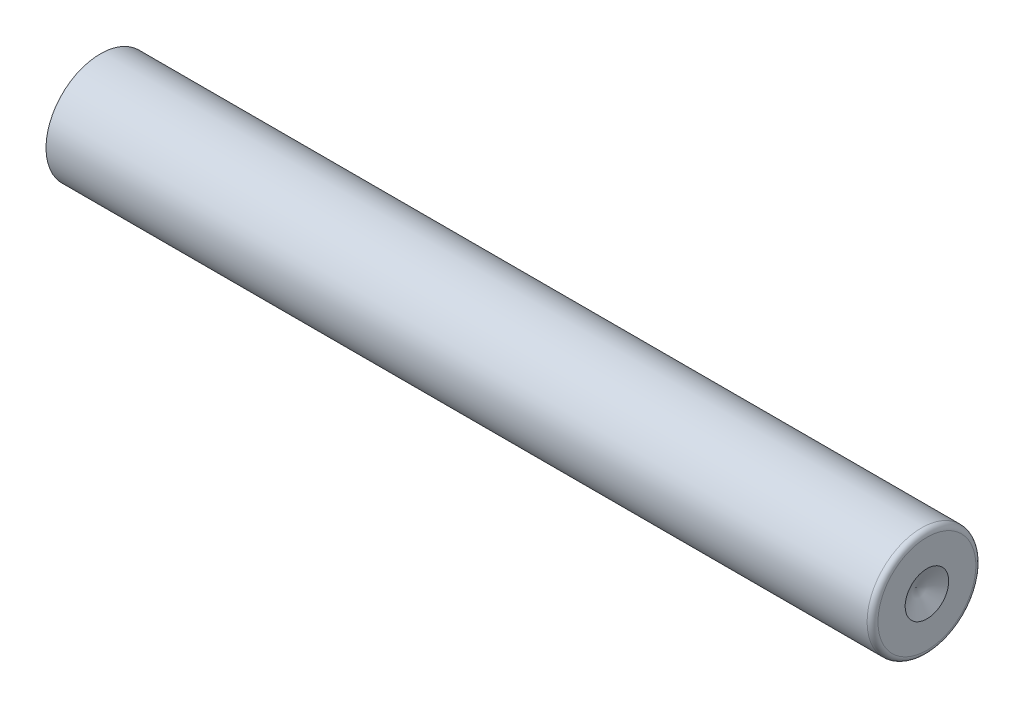
ISO-10303-21;
HEADER;
FILE_DESCRIPTION(('STEP AP214'),'2;1');
FILE_NAME('part.step','',(''),(''),'','','');
FILE_SCHEMA(('AUTOMOTIVE_DESIGN { 1 0 10303 214 1 1 1 1 }'));
ENDSEC;
DATA;
#1=APPLICATION_CONTEXT('core data for automotive mechanical design processes');
#2=APPLICATION_PROTOCOL_DEFINITION('international standard','automotive_design',2000,#1);
#3=PRODUCT_CONTEXT('',#1,'mechanical');
#4=PRODUCT('Part','Part','',(#3));
#5=PRODUCT_RELATED_PRODUCT_CATEGORY('part','',(#4));
#6=PRODUCT_DEFINITION_FORMATION('','',#4);
#7=PRODUCT_DEFINITION_CONTEXT('part definition',#1,'design');
#8=PRODUCT_DEFINITION('design','',#6,#7);
#9=PRODUCT_DEFINITION_SHAPE('','',#8);
#10=(LENGTH_UNIT() NAMED_UNIT(*) SI_UNIT(.MILLI.,.METRE.));
#11=(NAMED_UNIT(*) PLANE_ANGLE_UNIT() SI_UNIT($,.RADIAN.));
#12=(NAMED_UNIT(*) SI_UNIT($,.STERADIAN.) SOLID_ANGLE_UNIT());
#13=UNCERTAINTY_MEASURE_WITH_UNIT(LENGTH_MEASURE(1.E-05),#10,'distance_accuracy_value','');
#14=(GEOMETRIC_REPRESENTATION_CONTEXT(3) GLOBAL_UNCERTAINTY_ASSIGNED_CONTEXT((#13)) GLOBAL_UNIT_ASSIGNED_CONTEXT((#10,
#11,#12)) REPRESENTATION_CONTEXT('',''));
#15=CARTESIAN_POINT('',(0.,0.,0.));
#16=DIRECTION('',(0.,0.,1.));
#17=DIRECTION('',(1.,0.,0.));
#18=AXIS2_PLACEMENT_3D('',#15,#16,#17);
#19=CARTESIAN_POINT('',(0.,0.,0.));
#20=DIRECTION('',(1.,0.,0.));
#21=DIRECTION('',(0.,0.,-1.));
#22=AXIS2_PLACEMENT_3D('',#19,#20,#21);
#23=PLANE('',#22);
#24=CARTESIAN_POINT('',(0.,0.,0.));
#25=DIRECTION('',(-1.,0.,0.));
#26=DIRECTION('',(0.,0.,1.));
#27=AXIS2_PLACEMENT_3D('',#24,#25,#26);
#28=CIRCLE('',#27,2.5);
#29=CARTESIAN_POINT('',(0.,0.,2.5));
#30=VERTEX_POINT('',#29);
#31=EDGE_CURVE('E50',#30,#30,#28,.T.);
#32=ORIENTED_EDGE('',*,*,#31,.T.);
#33=EDGE_LOOP('',(#32));
#34=FACE_BOUND('',#33,.T.);
#35=ADVANCED_FACE('F32',(#34),#23,.F.);
#36=CARTESIAN_POINT('',(0.,0.,0.));
#37=DIRECTION('',(-1.,0.,0.));
#38=DIRECTION('',(0.,0.,1.));
#39=AXIS2_PLACEMENT_3D('',#36,#37,#38);
#40=CYLINDRICAL_SURFACE('',#39,2.5);
#41=CARTESIAN_POINT('',(37.75,0.,0.));
#42=DIRECTION('',(-1.,0.,0.));
#43=DIRECTION('',(0.,0.,1.));
#44=AXIS2_PLACEMENT_3D('',#41,#42,#43);
#45=CIRCLE('',#44,2.5);
#46=CARTESIAN_POINT('',(37.75,0.,2.5));
#47=VERTEX_POINT('',#46);
#48=EDGE_CURVE('E39',#47,#47,#45,.T.);
#49=ORIENTED_EDGE('',*,*,#48,.T.);
#50=EDGE_LOOP('',(#49));
#51=FACE_BOUND('',#50,.T.);
#52=ORIENTED_EDGE('',*,*,#31,.F.);
#53=EDGE_LOOP('',(#52));
#54=FACE_BOUND('',#53,.T.);
#55=ADVANCED_FACE('F57',(#51,#54),#40,.T.);
#56=CARTESIAN_POINT('',(38.,0.,0.));
#57=DIRECTION('',(-1.,0.,0.));
#58=DIRECTION('',(0.,0.,1.));
#59=AXIS2_PLACEMENT_3D('',#56,#57,#58);
#60=PLANE('',#59);
#61=CARTESIAN_POINT('',(38.,0.,0.));
#62=DIRECTION('',(1.,0.,0.));
#63=DIRECTION('',(0.,1.,0.));
#64=AXIS2_PLACEMENT_3D('',#61,#62,#63);
#65=CIRCLE('',#64,1.);
#66=CARTESIAN_POINT('',(38.,1.,0.));
#67=VERTEX_POINT('',#66);
#68=EDGE_CURVE('E48',#67,#67,#65,.T.);
#69=ORIENTED_EDGE('',*,*,#68,.F.);
#70=EDGE_LOOP('',(#69));
#71=FACE_BOUND('',#70,.T.);
#72=CARTESIAN_POINT('',(38.,0.,0.));
#73=DIRECTION('',(-1.,0.,0.));
#74=DIRECTION('',(0.,0.,1.));
#75=AXIS2_PLACEMENT_3D('',#72,#73,#74);
#76=CIRCLE('',#75,2.25);
#77=CARTESIAN_POINT('',(38.,0.,2.25));
#78=VERTEX_POINT('',#77);
#79=EDGE_CURVE('E11',#78,#78,#76,.F.);
#80=ORIENTED_EDGE('',*,*,#79,.T.);
#81=EDGE_LOOP('',(#80));
#82=FACE_BOUND('',#81,.T.);
#83=ADVANCED_FACE('F61',(#71,#82),#60,.F.);
#84=CARTESIAN_POINT('',(37.75,0.,0.));
#85=DIRECTION('',(-1.,0.,0.));
#86=DIRECTION('',(0.,0.,1.));
#87=AXIS2_PLACEMENT_3D('',#84,#85,#86);
#88=TOROIDAL_SURFACE('',#87,2.25,0.25);
#89=ORIENTED_EDGE('',*,*,#79,.F.);
#90=EDGE_LOOP('',(#89));
#91=FACE_BOUND('',#90,.T.);
#92=ORIENTED_EDGE('',*,*,#48,.F.);
#93=EDGE_LOOP('',(#92));
#94=FACE_BOUND('',#93,.T.);
#95=ADVANCED_FACE('F34',(#91,#94),#88,.T.);
#96=CARTESIAN_POINT('',(38.,0.,0.));
#97=DIRECTION('',(1.,0.,0.));
#98=DIRECTION('',(0.,1.,0.));
#99=AXIS2_PLACEMENT_3D('',#96,#97,#98);
#100=CONICAL_SURFACE('',#99,1.,1.10714871779408);
#101=CARTESIAN_POINT('',(37.5,0.,0.));
#102=VERTEX_POINT('',#101);
#103=VERTEX_LOOP('',#102);
#104=FACE_BOUND('',#103,.T.);
#105=ORIENTED_EDGE('',*,*,#68,.T.);
#106=EDGE_LOOP('',(#105));
#107=FACE_BOUND('',#106,.T.);
#108=ADVANCED_FACE('F42',(#104,#107),#100,.F.);
#109=CLOSED_SHELL('',(#35,#55,#83,#95,#108));
#110=MANIFOLD_SOLID_BREP('B2',#109);
#111=ADVANCED_BREP_SHAPE_REPRESENTATION('',(#18,#110),#14);
#112=SHAPE_DEFINITION_REPRESENTATION(#9,#111);
ENDSEC;
END-ISO-10303-21;
